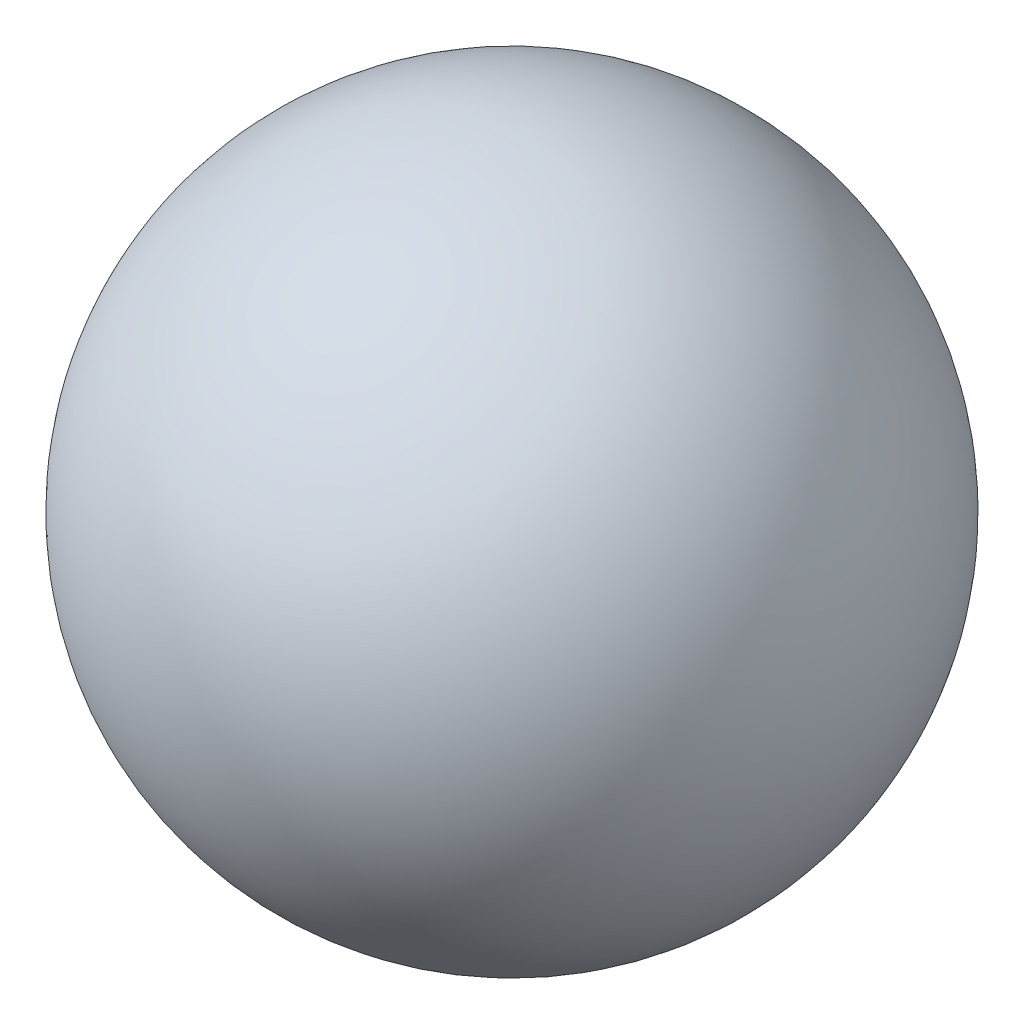
ISO-10303-21;
HEADER;
FILE_DESCRIPTION(('STEP AP214'),'2;1');
FILE_NAME('part.step','',(''),(''),'','','');
FILE_SCHEMA(('AUTOMOTIVE_DESIGN { 1 0 10303 214 1 1 1 1 }'));
ENDSEC;
DATA;
#1=APPLICATION_CONTEXT('core data for automotive mechanical design processes');
#2=APPLICATION_PROTOCOL_DEFINITION('international standard','automotive_design',2000,#1);
#3=PRODUCT_CONTEXT('',#1,'mechanical');
#4=PRODUCT('Part','Part','',(#3));
#5=PRODUCT_RELATED_PRODUCT_CATEGORY('part','',(#4));
#6=PRODUCT_DEFINITION_FORMATION('','',#4);
#7=PRODUCT_DEFINITION_CONTEXT('part definition',#1,'design');
#8=PRODUCT_DEFINITION('design','',#6,#7);
#9=PRODUCT_DEFINITION_SHAPE('','',#8);
#10=(LENGTH_UNIT() NAMED_UNIT(*) SI_UNIT(.MILLI.,.METRE.));
#11=(NAMED_UNIT(*) PLANE_ANGLE_UNIT() SI_UNIT($,.RADIAN.));
#12=(NAMED_UNIT(*) SI_UNIT($,.STERADIAN.) SOLID_ANGLE_UNIT());
#13=UNCERTAINTY_MEASURE_WITH_UNIT(LENGTH_MEASURE(1.E-05),#10,'distance_accuracy_value','');
#14=(GEOMETRIC_REPRESENTATION_CONTEXT(3) GLOBAL_UNCERTAINTY_ASSIGNED_CONTEXT((#13)) GLOBAL_UNIT_ASSIGNED_CONTEXT((#10,
#11,#12)) REPRESENTATION_CONTEXT('',''));
#15=CARTESIAN_POINT('',(0.,0.,0.));
#16=DIRECTION('',(0.,0.,1.));
#17=DIRECTION('',(1.,0.,0.));
#18=AXIS2_PLACEMENT_3D('',#15,#16,#17);
#19=CARTESIAN_POINT('',(0.,0.,0.));
#20=DIRECTION('',(-1.,0.,0.));
#21=DIRECTION('',(0.,1.,0.));
#22=AXIS2_PLACEMENT_3D('',#19,#20,#21);
#23=SPHERICAL_SURFACE('',#22,12.);
#24=CARTESIAN_POINT('',(-12.,0.,0.));
#25=VERTEX_POINT('',#24);
#26=VERTEX_LOOP('',#25);
#27=FACE_BOUND('',#26,.T.);
#28=ADVANCED_FACE('F33',(#27),#23,.T.);
#29=CLOSED_SHELL('',(#28));
#30=MANIFOLD_SOLID_BREP('B2',#29);
#31=ADVANCED_BREP_SHAPE_REPRESENTATION('',(#18,#30),#14);
#32=SHAPE_DEFINITION_REPRESENTATION(#9,#31);
ENDSEC;
END-ISO-10303-21;
